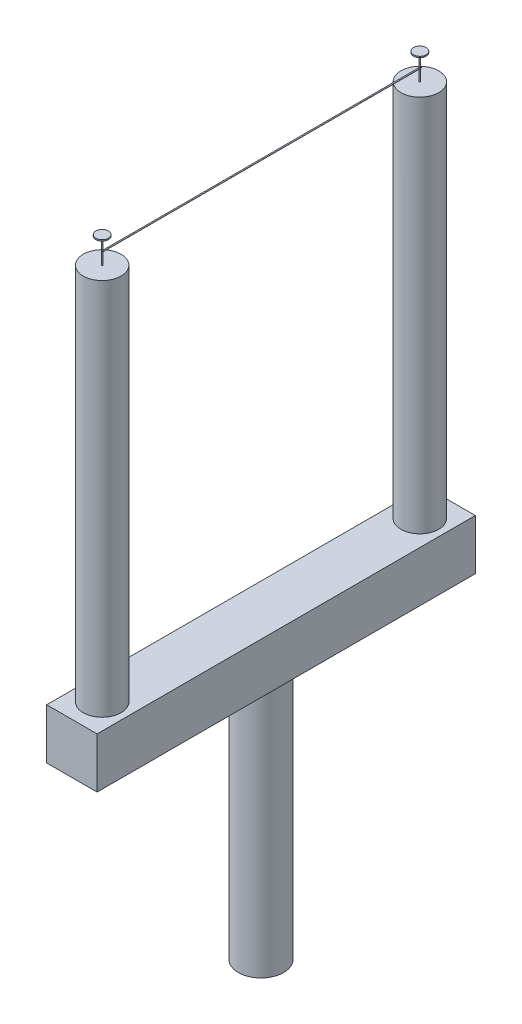
ISO-10303-21;
HEADER;
FILE_DESCRIPTION(('STEP AP214'),'2;1');
FILE_NAME('part.step','',(''),(''),'','','');
FILE_SCHEMA(('AUTOMOTIVE_DESIGN { 1 0 10303 214 1 1 1 1 }'));
ENDSEC;
DATA;
#1=APPLICATION_CONTEXT('core data for automotive mechanical design processes');
#2=APPLICATION_PROTOCOL_DEFINITION('international standard','automotive_design',2000,#1);
#3=PRODUCT_CONTEXT('',#1,'mechanical');
#4=PRODUCT('Part','Part','',(#3));
#5=PRODUCT_RELATED_PRODUCT_CATEGORY('part','',(#4));
#6=PRODUCT_DEFINITION_FORMATION('','',#4);
#7=PRODUCT_DEFINITION_CONTEXT('part definition',#1,'design');
#8=PRODUCT_DEFINITION('design','',#6,#7);
#9=PRODUCT_DEFINITION_SHAPE('','',#8);
#10=(LENGTH_UNIT() NAMED_UNIT(*) SI_UNIT(.MILLI.,.METRE.));
#11=(NAMED_UNIT(*) PLANE_ANGLE_UNIT() SI_UNIT($,.RADIAN.));
#12=(NAMED_UNIT(*) SI_UNIT($,.STERADIAN.) SOLID_ANGLE_UNIT());
#13=UNCERTAINTY_MEASURE_WITH_UNIT(LENGTH_MEASURE(1.E-05),#10,'distance_accuracy_value','');
#14=(GEOMETRIC_REPRESENTATION_CONTEXT(3) GLOBAL_UNCERTAINTY_ASSIGNED_CONTEXT((#13)) GLOBAL_UNIT_ASSIGNED_CONTEXT((#10,
#11,#12)) REPRESENTATION_CONTEXT('',''));
#15=CARTESIAN_POINT('',(0.,0.,0.));
#16=DIRECTION('',(0.,0.,1.));
#17=DIRECTION('',(1.,0.,0.));
#18=AXIS2_PLACEMENT_3D('',#15,#16,#17);
#19=CARTESIAN_POINT('',(0.,170.,138.));
#20=DIRECTION('',(0.,-1.,0.));
#21=DIRECTION('',(0.,0.,-1.));
#22=AXIS2_PLACEMENT_3D('',#19,#20,#21);
#23=CYLINDRICAL_SURFACE('',#22,0.25);
#24=CARTESIAN_POINT('',(0.,160.,138.));
#25=DIRECTION('',(0.,1.,0.));
#26=DIRECTION('',(0.,0.,1.));
#27=AXIS2_PLACEMENT_3D('',#24,#25,#26);
#28=CIRCLE('',#27,0.25);
#29=CARTESIAN_POINT('',(0.,160.,138.25));
#30=VERTEX_POINT('',#29);
#31=EDGE_CURVE('E153',#30,#30,#28,.T.);
#32=ORIENTED_EDGE('',*,*,#31,.T.);
#33=EDGE_LOOP('',(#32));
#34=FACE_BOUND('',#33,.T.);
#35=CARTESIAN_POINT('',(0.,170.,138.));
#36=DIRECTION('',(0.,1.,0.));
#37=DIRECTION('',(0.,0.,1.));
#38=AXIS2_PLACEMENT_3D('',#35,#36,#37);
#39=CIRCLE('',#38,0.25);
#40=CARTESIAN_POINT('',(0.,170.,138.25));
#41=VERTEX_POINT('',#40);
#42=EDGE_CURVE('E156',#41,#41,#39,.T.);
#43=ORIENTED_EDGE('',*,*,#42,.F.);
#44=EDGE_LOOP('',(#43));
#45=FACE_BOUND('',#44,.T.);
#46=CARTESIAN_POINT('',(0.,165.,138.));
#47=DIRECTION('',(0.,-1.,0.));
#48=DIRECTION('',(0.,0.,-1.));
#49=AXIS2_PLACEMENT_3D('',#46,#47,#48);
#50=CIRCLE('',#49,0.25);
#51=CARTESIAN_POINT('',(0.,165.,137.75));
#52=VERTEX_POINT('',#51);
#53=CARTESIAN_POINT('',(0.,165.,138.25));
#54=VERTEX_POINT('',#53);
#55=EDGE_CURVE('E11',#52,#54,#50,.T.);
#56=ORIENTED_EDGE('',*,*,#55,.F.);
#57=DIRECTION('',(0.,-1.,0.));
#58=VECTOR('',#57,1.);
#59=CARTESIAN_POINT('',(0.,170.,137.75));
#60=LINE('',#59,#58);
#61=CARTESIAN_POINT('',(0.,164.9,137.75));
#62=VERTEX_POINT('',#61);
#63=EDGE_CURVE('E41',#52,#62,#60,.T.);
#64=ORIENTED_EDGE('',*,*,#63,.T.);
#65=CARTESIAN_POINT('',(0.,164.9,138.));
#66=DIRECTION('',(0.,1.,0.));
#67=DIRECTION('',(0.,0.,1.));
#68=AXIS2_PLACEMENT_3D('',#65,#66,#67);
#69=CIRCLE('',#68,0.25);
#70=CARTESIAN_POINT('',(0.,164.9,138.25));
#71=VERTEX_POINT('',#70);
#72=EDGE_CURVE('E215',#71,#62,#69,.T.);
#73=ORIENTED_EDGE('',*,*,#72,.F.);
#74=DIRECTION('',(0.,-1.,0.));
#75=VECTOR('',#74,1.);
#76=CARTESIAN_POINT('',(0.,165.,138.25));
#77=LINE('',#76,#75);
#78=EDGE_CURVE('E224',#54,#71,#77,.T.);
#79=ORIENTED_EDGE('',*,*,#78,.F.);
#80=EDGE_LOOP('',(#56,#64,#73,#79));
#81=FACE_BOUND('',#80,.T.);
#82=ADVANCED_FACE('F33',(#34,#45,#81),#23,.T.);
#83=CARTESIAN_POINT('',(10.,-10.,150.));
#84=DIRECTION('',(-1.,0.,0.));
#85=DIRECTION('',(0.,0.,1.));
#86=AXIS2_PLACEMENT_3D('',#83,#84,#85);
#87=PLANE('',#86);
#88=DIRECTION('',(0.,1.,0.));
#89=VECTOR('',#88,1.);
#90=CARTESIAN_POINT('',(10.,-10.,0.));
#91=LINE('',#90,#89);
#92=CARTESIAN_POINT('',(10.,-10.,0.));
#93=VERTEX_POINT('',#92);
#94=CARTESIAN_POINT('',(10.,10.,0.));
#95=VERTEX_POINT('',#94);
#96=EDGE_CURVE('E176',#93,#95,#91,.T.);
#97=ORIENTED_EDGE('',*,*,#96,.T.);
#98=DIRECTION('',(0.,0.,-1.));
#99=VECTOR('',#98,1.);
#100=CARTESIAN_POINT('',(10.,10.,150.));
#101=LINE('',#100,#99);
#102=CARTESIAN_POINT('',(10.,10.,150.));
#103=VERTEX_POINT('',#102);
#104=EDGE_CURVE('E203',#103,#95,#101,.T.);
#105=ORIENTED_EDGE('',*,*,#104,.F.);
#106=DIRECTION('',(0.,1.,0.));
#107=VECTOR('',#106,1.);
#108=CARTESIAN_POINT('',(10.,-10.,150.));
#109=LINE('',#108,#107);
#110=CARTESIAN_POINT('',(10.,-10.,150.));
#111=VERTEX_POINT('',#110);
#112=EDGE_CURVE('E177',#111,#103,#109,.T.);
#113=ORIENTED_EDGE('',*,*,#112,.F.);
#114=DIRECTION('',(0.,0.,-1.));
#115=VECTOR('',#114,1.);
#116=CARTESIAN_POINT('',(10.,-10.,150.));
#117=LINE('',#116,#115);
#118=EDGE_CURVE('E187',#111,#93,#117,.T.);
#119=ORIENTED_EDGE('',*,*,#118,.T.);
#120=EDGE_LOOP('',(#97,#105,#113,#119));
#121=FACE_BOUND('',#120,.T.);
#122=ADVANCED_FACE('F35',(#121),#87,.F.);
#123=CARTESIAN_POINT('',(-10.,10.,150.));
#124=DIRECTION('',(0.,-1.,0.));
#125=DIRECTION('',(0.,0.,-1.));
#126=AXIS2_PLACEMENT_3D('',#123,#124,#125);
#127=PLANE('',#126);
#128=CARTESIAN_POINT('',(0.,10.,138.));
#129=DIRECTION('',(0.,-1.,0.));
#130=DIRECTION('',(0.,0.,-1.));
#131=AXIS2_PLACEMENT_3D('',#128,#129,#130);
#132=CIRCLE('',#131,7.5);
#133=CARTESIAN_POINT('',(0.,10.,130.5));
#134=VERTEX_POINT('',#133);
#135=EDGE_CURVE('E212',#134,#134,#132,.F.);
#136=ORIENTED_EDGE('',*,*,#135,.F.);
#137=EDGE_LOOP('',(#136));
#138=FACE_BOUND('',#137,.T.);
#139=CARTESIAN_POINT('',(0.,10.,12.));
#140=DIRECTION('',(0.,-1.,0.));
#141=DIRECTION('',(0.,0.,-1.));
#142=AXIS2_PLACEMENT_3D('',#139,#140,#141);
#143=CIRCLE('',#142,7.5);
#144=CARTESIAN_POINT('',(0.,10.,4.5));
#145=VERTEX_POINT('',#144);
#146=EDGE_CURVE('E209',#145,#145,#143,.F.);
#147=ORIENTED_EDGE('',*,*,#146,.F.);
#148=EDGE_LOOP('',(#147));
#149=FACE_BOUND('',#148,.T.);
#150=DIRECTION('',(-1.,0.,0.));
#151=VECTOR('',#150,1.);
#152=CARTESIAN_POINT('',(-10.,10.,0.));
#153=LINE('',#152,#151);
#154=CARTESIAN_POINT('',(-10.,10.,0.));
#155=VERTEX_POINT('',#154);
#156=EDGE_CURVE('E190',#95,#155,#153,.T.);
#157=ORIENTED_EDGE('',*,*,#156,.T.);
#158=DIRECTION('',(0.,0.,-1.));
#159=VECTOR('',#158,1.);
#160=CARTESIAN_POINT('',(-10.,10.,150.));
#161=LINE('',#160,#159);
#162=CARTESIAN_POINT('',(-10.,10.,150.));
#163=VERTEX_POINT('',#162);
#164=EDGE_CURVE('E200',#163,#155,#161,.T.);
#165=ORIENTED_EDGE('',*,*,#164,.F.);
#166=DIRECTION('',(-1.,0.,0.));
#167=VECTOR('',#166,1.);
#168=CARTESIAN_POINT('',(-10.,10.,150.));
#169=LINE('',#168,#167);
#170=EDGE_CURVE('E180',#103,#163,#169,.T.);
#171=ORIENTED_EDGE('',*,*,#170,.F.);
#172=ORIENTED_EDGE('',*,*,#104,.T.);
#173=EDGE_LOOP('',(#157,#165,#171,#172));
#174=FACE_BOUND('',#173,.T.);
#175=ADVANCED_FACE('F252',(#138,#149,#174),#127,.F.);
#176=CARTESIAN_POINT('',(-10.,-10.,150.));
#177=DIRECTION('',(1.,0.,0.));
#178=DIRECTION('',(0.,0.,-1.));
#179=AXIS2_PLACEMENT_3D('',#176,#177,#178);
#180=PLANE('',#179);
#181=DIRECTION('',(0.,-1.,0.));
#182=VECTOR('',#181,1.);
#183=CARTESIAN_POINT('',(-10.,-10.,0.));
#184=LINE('',#183,#182);
#185=CARTESIAN_POINT('',(-10.,-10.,0.));
#186=VERTEX_POINT('',#185);
#187=EDGE_CURVE('E192',#155,#186,#184,.T.);
#188=ORIENTED_EDGE('',*,*,#187,.T.);
#189=DIRECTION('',(0.,0.,-1.));
#190=VECTOR('',#189,1.);
#191=CARTESIAN_POINT('',(-10.,-10.,150.));
#192=LINE('',#191,#190);
#193=CARTESIAN_POINT('',(-10.,-10.,150.));
#194=VERTEX_POINT('',#193);
#195=EDGE_CURVE('E197',#194,#186,#192,.T.);
#196=ORIENTED_EDGE('',*,*,#195,.F.);
#197=DIRECTION('',(0.,-1.,0.));
#198=VECTOR('',#197,1.);
#199=CARTESIAN_POINT('',(-10.,-10.,150.));
#200=LINE('',#199,#198);
#201=EDGE_CURVE('E183',#163,#194,#200,.T.);
#202=ORIENTED_EDGE('',*,*,#201,.F.);
#203=ORIENTED_EDGE('',*,*,#164,.T.);
#204=EDGE_LOOP('',(#188,#196,#202,#203));
#205=FACE_BOUND('',#204,.T.);
#206=ADVANCED_FACE('F298',(#205),#180,.F.);
#207=CARTESIAN_POINT('',(-10.,-10.,150.));
#208=DIRECTION('',(0.,1.,0.));
#209=DIRECTION('',(0.,0.,1.));
#210=AXIS2_PLACEMENT_3D('',#207,#208,#209);
#211=PLANE('',#210);
#212=CARTESIAN_POINT('',(0.,-9.99999999999999,75.));
#213=DIRECTION('',(0.,1.,0.));
#214=DIRECTION('',(0.,0.,1.));
#215=AXIS2_PLACEMENT_3D('',#212,#213,#214);
#216=CIRCLE('',#215,9.00000000000001);
#217=CARTESIAN_POINT('',(0.,-9.99999999999999,84.));
#218=VERTEX_POINT('',#217);
#219=EDGE_CURVE('E206',#218,#218,#216,.F.);
#220=ORIENTED_EDGE('',*,*,#219,.F.);
#221=EDGE_LOOP('',(#220));
#222=FACE_BOUND('',#221,.T.);
#223=DIRECTION('',(1.,0.,0.));
#224=VECTOR('',#223,1.);
#225=CARTESIAN_POINT('',(-10.,-10.,0.));
#226=LINE('',#225,#224);
#227=EDGE_CURVE('E181',#186,#93,#226,.T.);
#228=ORIENTED_EDGE('',*,*,#227,.T.);
#229=ORIENTED_EDGE('',*,*,#118,.F.);
#230=DIRECTION('',(1.,0.,0.));
#231=VECTOR('',#230,1.);
#232=CARTESIAN_POINT('',(-10.,-10.,150.));
#233=LINE('',#232,#231);
#234=EDGE_CURVE('E185',#194,#111,#233,.T.);
#235=ORIENTED_EDGE('',*,*,#234,.F.);
#236=ORIENTED_EDGE('',*,*,#195,.T.);
#237=EDGE_LOOP('',(#228,#229,#235,#236));
#238=FACE_BOUND('',#237,.T.);
#239=ADVANCED_FACE('F291',(#222,#238),#211,.F.);
#240=CARTESIAN_POINT('',(0.,0.,150.));
#241=DIRECTION('',(0.,0.,-1.));
#242=DIRECTION('',(-1.,0.,0.));
#243=AXIS2_PLACEMENT_3D('',#240,#241,#242);
#244=PLANE('',#243);
#245=ORIENTED_EDGE('',*,*,#112,.T.);
#246=ORIENTED_EDGE('',*,*,#170,.T.);
#247=ORIENTED_EDGE('',*,*,#201,.T.);
#248=ORIENTED_EDGE('',*,*,#234,.T.);
#249=EDGE_LOOP('',(#245,#246,#247,#248));
#250=FACE_BOUND('',#249,.T.);
#251=ADVANCED_FACE('F288',(#250),#244,.F.);
#252=CARTESIAN_POINT('',(0.,0.,0.));
#253=DIRECTION('',(0.,0.,-1.));
#254=DIRECTION('',(-1.,0.,0.));
#255=AXIS2_PLACEMENT_3D('',#252,#253,#254);
#256=PLANE('',#255);
#257=ORIENTED_EDGE('',*,*,#96,.F.);
#258=ORIENTED_EDGE('',*,*,#227,.F.);
#259=ORIENTED_EDGE('',*,*,#187,.F.);
#260=ORIENTED_EDGE('',*,*,#156,.F.);
#261=EDGE_LOOP('',(#257,#258,#259,#260));
#262=FACE_BOUND('',#261,.T.);
#263=ADVANCED_FACE('F286',(#262),#256,.T.);
#264=CARTESIAN_POINT('',(0.,-110.,75.));
#265=DIRECTION('',(0.,1.,0.));
#266=DIRECTION('',(0.,0.,1.));
#267=AXIS2_PLACEMENT_3D('',#264,#265,#266);
#268=CYLINDRICAL_SURFACE('',#267,9.00000000000001);
#269=CARTESIAN_POINT('',(0.,-110.,75.));
#270=DIRECTION('',(0.,-1.,0.));
#271=DIRECTION('',(0.,0.,-1.));
#272=AXIS2_PLACEMENT_3D('',#269,#270,#271);
#273=CIRCLE('',#272,9.00000000000001);
#274=CARTESIAN_POINT('',(0.,-110.,66.));
#275=VERTEX_POINT('',#274);
#276=EDGE_CURVE('E173',#275,#275,#273,.T.);
#277=ORIENTED_EDGE('',*,*,#276,.F.);
#278=EDGE_LOOP('',(#277));
#279=FACE_BOUND('',#278,.T.);
#280=ORIENTED_EDGE('',*,*,#219,.T.);
#281=EDGE_LOOP('',(#280));
#282=FACE_BOUND('',#281,.T.);
#283=ADVANCED_FACE('F282',(#279,#282),#268,.T.);
#284=CARTESIAN_POINT('',(0.,-110.,75.));
#285=DIRECTION('',(0.,-1.,0.));
#286=DIRECTION('',(0.,0.,-1.));
#287=AXIS2_PLACEMENT_3D('',#284,#285,#286);
#288=PLANE('',#287);
#289=ORIENTED_EDGE('',*,*,#276,.T.);
#290=EDGE_LOOP('',(#289));
#291=FACE_BOUND('',#290,.T.);
#292=ADVANCED_FACE('F278',(#291),#288,.T.);
#293=CARTESIAN_POINT('',(0.,160.,12.));
#294=DIRECTION('',(0.,-1.,0.));
#295=DIRECTION('',(0.,0.,-1.));
#296=AXIS2_PLACEMENT_3D('',#293,#294,#295);
#297=CYLINDRICAL_SURFACE('',#296,7.5);
#298=CARTESIAN_POINT('',(0.,160.,12.));
#299=DIRECTION('',(0.,1.,0.));
#300=DIRECTION('',(0.,0.,1.));
#301=AXIS2_PLACEMENT_3D('',#298,#299,#300);
#302=CIRCLE('',#301,7.5);
#303=CARTESIAN_POINT('',(0.,160.,19.5));
#304=VERTEX_POINT('',#303);
#305=EDGE_CURVE('E170',#304,#304,#302,.T.);
#306=ORIENTED_EDGE('',*,*,#305,.F.);
#307=EDGE_LOOP('',(#306));
#308=FACE_BOUND('',#307,.T.);
#309=ORIENTED_EDGE('',*,*,#146,.T.);
#310=EDGE_LOOP('',(#309));
#311=FACE_BOUND('',#310,.T.);
#312=ADVANCED_FACE('F274',(#308,#311),#297,.T.);
#313=CARTESIAN_POINT('',(0.,160.,12.));
#314=DIRECTION('',(0.,1.,0.));
#315=DIRECTION('',(0.,0.,1.));
#316=AXIS2_PLACEMENT_3D('',#313,#314,#315);
#317=PLANE('',#316);
#318=CARTESIAN_POINT('',(0.,160.,12.));
#319=DIRECTION('',(0.,1.,0.));
#320=DIRECTION('',(0.,0.,1.));
#321=AXIS2_PLACEMENT_3D('',#318,#319,#320);
#322=CIRCLE('',#321,0.25);
#323=CARTESIAN_POINT('',(0.,160.,12.25));
#324=VERTEX_POINT('',#323);
#325=EDGE_CURVE('E159',#324,#324,#322,.T.);
#326=ORIENTED_EDGE('',*,*,#325,.F.);
#327=EDGE_LOOP('',(#326));
#328=FACE_BOUND('',#327,.T.);
#329=ORIENTED_EDGE('',*,*,#305,.T.);
#330=EDGE_LOOP('',(#329));
#331=FACE_BOUND('',#330,.T.);
#332=ADVANCED_FACE('F270',(#328,#331),#317,.T.);
#333=CARTESIAN_POINT('',(0.,160.,138.));
#334=DIRECTION('',(0.,-1.,0.));
#335=DIRECTION('',(0.,0.,-1.));
#336=AXIS2_PLACEMENT_3D('',#333,#334,#335);
#337=CYLINDRICAL_SURFACE('',#336,7.5);
#338=CARTESIAN_POINT('',(0.,160.,138.));
#339=DIRECTION('',(0.,1.,0.));
#340=DIRECTION('',(0.,0.,1.));
#341=AXIS2_PLACEMENT_3D('',#338,#339,#340);
#342=CIRCLE('',#341,7.5);
#343=CARTESIAN_POINT('',(0.,160.,145.5));
#344=VERTEX_POINT('',#343);
#345=EDGE_CURVE('E165',#344,#344,#342,.T.);
#346=ORIENTED_EDGE('',*,*,#345,.F.);
#347=EDGE_LOOP('',(#346));
#348=FACE_BOUND('',#347,.T.);
#349=ORIENTED_EDGE('',*,*,#135,.T.);
#350=EDGE_LOOP('',(#349));
#351=FACE_BOUND('',#350,.T.);
#352=ADVANCED_FACE('F266',(#348,#351),#337,.T.);
#353=CARTESIAN_POINT('',(0.,160.,138.));
#354=DIRECTION('',(0.,1.,0.));
#355=DIRECTION('',(0.,0.,1.));
#356=AXIS2_PLACEMENT_3D('',#353,#354,#355);
#357=PLANE('',#356);
#358=ORIENTED_EDGE('',*,*,#31,.F.);
#359=EDGE_LOOP('',(#358));
#360=FACE_BOUND('',#359,.T.);
#361=ORIENTED_EDGE('',*,*,#345,.T.);
#362=EDGE_LOOP('',(#361));
#363=FACE_BOUND('',#362,.T.);
#364=ADVANCED_FACE('F262',(#360,#363),#357,.T.);
#365=CARTESIAN_POINT('',(0.,170.,12.));
#366=DIRECTION('',(0.,-1.,0.));
#367=DIRECTION('',(0.,0.,-1.));
#368=AXIS2_PLACEMENT_3D('',#365,#366,#367);
#369=CYLINDRICAL_SURFACE('',#368,0.25);
#370=CARTESIAN_POINT('',(0.,165.,12.));
#371=DIRECTION('',(0.,-1.,0.));
#372=DIRECTION('',(0.,0.,-1.));
#373=AXIS2_PLACEMENT_3D('',#370,#371,#372);
#374=CIRCLE('',#373,0.25);
#375=CARTESIAN_POINT('',(0.,165.,11.75));
#376=VERTEX_POINT('',#375);
#377=CARTESIAN_POINT('',(0.,165.,12.25));
#378=VERTEX_POINT('',#377);
#379=EDGE_CURVE('E141',#376,#378,#374,.T.);
#380=ORIENTED_EDGE('',*,*,#379,.F.);
#381=DIRECTION('',(0.,1.,0.));
#382=VECTOR('',#381,1.);
#383=CARTESIAN_POINT('',(0.,165.,11.75));
#384=LINE('',#383,#382);
#385=CARTESIAN_POINT('',(0.,164.9,11.75));
#386=VERTEX_POINT('',#385);
#387=EDGE_CURVE('E129',#386,#376,#384,.T.);
#388=ORIENTED_EDGE('',*,*,#387,.F.);
#389=CARTESIAN_POINT('',(0.,164.9,12.));
#390=DIRECTION('',(0.,1.,0.));
#391=DIRECTION('',(0.,0.,1.));
#392=AXIS2_PLACEMENT_3D('',#389,#390,#391);
#393=CIRCLE('',#392,0.25);
#394=CARTESIAN_POINT('',(0.,164.9,12.25));
#395=VERTEX_POINT('',#394);
#396=EDGE_CURVE('E134',#395,#386,#393,.T.);
#397=ORIENTED_EDGE('',*,*,#396,.F.);
#398=DIRECTION('',(0.,-1.,0.));
#399=VECTOR('',#398,1.);
#400=CARTESIAN_POINT('',(0.,170.,12.25));
#401=LINE('',#400,#399);
#402=EDGE_CURVE('E131',#395,#378,#401,.F.);
#403=ORIENTED_EDGE('',*,*,#402,.T.);
#404=EDGE_LOOP('',(#380,#388,#397,#403));
#405=FACE_BOUND('',#404,.T.);
#406=CARTESIAN_POINT('',(0.,170.,12.));
#407=DIRECTION('',(0.,1.,0.));
#408=DIRECTION('',(0.,0.,1.));
#409=AXIS2_PLACEMENT_3D('',#406,#407,#408);
#410=CIRCLE('',#409,0.25);
#411=CARTESIAN_POINT('',(0.,170.,12.25));
#412=VERTEX_POINT('',#411);
#413=EDGE_CURVE('E162',#412,#412,#410,.T.);
#414=ORIENTED_EDGE('',*,*,#413,.F.);
#415=EDGE_LOOP('',(#414));
#416=FACE_BOUND('',#415,.T.);
#417=ORIENTED_EDGE('',*,*,#325,.T.);
#418=EDGE_LOOP('',(#417));
#419=FACE_BOUND('',#418,.T.);
#420=ADVANCED_FACE('F259',(#405,#416,#419),#369,.T.);
#421=CARTESIAN_POINT('',(0.,170.5,12.));
#422=DIRECTION('',(0.,-1.,0.));
#423=DIRECTION('',(0.,0.,-1.));
#424=AXIS2_PLACEMENT_3D('',#421,#422,#423);
#425=CYLINDRICAL_SURFACE('',#424,2.5);
#426=CARTESIAN_POINT('',(0.,170.5,12.));
#427=DIRECTION('',(0.,1.,0.));
#428=DIRECTION('',(0.,0.,1.));
#429=AXIS2_PLACEMENT_3D('',#426,#427,#428);
#430=CIRCLE('',#429,2.5);
#431=CARTESIAN_POINT('',(0.,170.5,14.5));
#432=VERTEX_POINT('',#431);
#433=EDGE_CURVE('E150',#432,#432,#430,.T.);
#434=ORIENTED_EDGE('',*,*,#433,.F.);
#435=EDGE_LOOP('',(#434));
#436=FACE_BOUND('',#435,.T.);
#437=CARTESIAN_POINT('',(0.,170.,12.));
#438=DIRECTION('',(0.,1.,0.));
#439=DIRECTION('',(0.,0.,1.));
#440=AXIS2_PLACEMENT_3D('',#437,#438,#439);
#441=CIRCLE('',#440,2.5);
#442=CARTESIAN_POINT('',(0.,170.,14.5));
#443=VERTEX_POINT('',#442);
#444=EDGE_CURVE('E147',#443,#443,#441,.T.);
#445=ORIENTED_EDGE('',*,*,#444,.T.);
#446=EDGE_LOOP('',(#445));
#447=FACE_BOUND('',#446,.T.);
#448=ADVANCED_FACE('F257',(#436,#447),#425,.T.);
#449=CARTESIAN_POINT('',(0.,170.5,12.));
#450=DIRECTION('',(0.,1.,0.));
#451=DIRECTION('',(0.,0.,1.));
#452=AXIS2_PLACEMENT_3D('',#449,#450,#451);
#453=PLANE('',#452);
#454=ORIENTED_EDGE('',*,*,#433,.T.);
#455=EDGE_LOOP('',(#454));
#456=FACE_BOUND('',#455,.T.);
#457=ADVANCED_FACE('F376',(#456),#453,.T.);
#458=CARTESIAN_POINT('',(0.,170.,12.));
#459=DIRECTION('',(0.,1.,0.));
#460=DIRECTION('',(0.,0.,1.));
#461=AXIS2_PLACEMENT_3D('',#458,#459,#460);
#462=PLANE('',#461);
#463=ORIENTED_EDGE('',*,*,#413,.T.);
#464=EDGE_LOOP('',(#463));
#465=FACE_BOUND('',#464,.T.);
#466=ORIENTED_EDGE('',*,*,#444,.F.);
#467=EDGE_LOOP('',(#466));
#468=FACE_BOUND('',#467,.T.);
#469=ADVANCED_FACE('F383',(#465,#468),#462,.F.);
#470=CARTESIAN_POINT('',(0.,170.5,138.));
#471=DIRECTION('',(0.,-1.,0.));
#472=DIRECTION('',(0.,0.,-1.));
#473=AXIS2_PLACEMENT_3D('',#470,#471,#472);
#474=CYLINDRICAL_SURFACE('',#473,2.5);
#475=CARTESIAN_POINT('',(0.,170.5,138.));
#476=DIRECTION('',(0.,1.,0.));
#477=DIRECTION('',(0.,0.,1.));
#478=AXIS2_PLACEMENT_3D('',#475,#476,#477);
#479=CIRCLE('',#478,2.5);
#480=CARTESIAN_POINT('',(0.,170.5,140.5));
#481=VERTEX_POINT('',#480);
#482=EDGE_CURVE('E144',#481,#481,#479,.T.);
#483=ORIENTED_EDGE('',*,*,#482,.F.);
#484=EDGE_LOOP('',(#483));
#485=FACE_BOUND('',#484,.T.);
#486=CARTESIAN_POINT('',(0.,170.,138.));
#487=DIRECTION('',(0.,1.,0.));
#488=DIRECTION('',(0.,0.,1.));
#489=AXIS2_PLACEMENT_3D('',#486,#487,#488);
#490=CIRCLE('',#489,2.5);
#491=CARTESIAN_POINT('',(0.,170.,140.5));
#492=VERTEX_POINT('',#491);
#493=EDGE_CURVE('E143',#492,#492,#490,.T.);
#494=ORIENTED_EDGE('',*,*,#493,.T.);
#495=EDGE_LOOP('',(#494));
#496=FACE_BOUND('',#495,.T.);
#497=ADVANCED_FACE('F391',(#485,#496),#474,.T.);
#498=CARTESIAN_POINT('',(0.,170.5,138.));
#499=DIRECTION('',(0.,1.,0.));
#500=DIRECTION('',(0.,0.,1.));
#501=AXIS2_PLACEMENT_3D('',#498,#499,#500);
#502=PLANE('',#501);
#503=ORIENTED_EDGE('',*,*,#482,.T.);
#504=EDGE_LOOP('',(#503));
#505=FACE_BOUND('',#504,.T.);
#506=ADVANCED_FACE('F398',(#505),#502,.T.);
#507=CARTESIAN_POINT('',(0.,170.,138.));
#508=DIRECTION('',(0.,1.,0.));
#509=DIRECTION('',(0.,0.,1.));
#510=AXIS2_PLACEMENT_3D('',#507,#508,#509);
#511=PLANE('',#510);
#512=ORIENTED_EDGE('',*,*,#42,.T.);
#513=EDGE_LOOP('',(#512));
#514=FACE_BOUND('',#513,.T.);
#515=ORIENTED_EDGE('',*,*,#493,.F.);
#516=EDGE_LOOP('',(#515));
#517=FACE_BOUND('',#516,.T.);
#518=ADVANCED_FACE('F406',(#514,#517),#511,.F.);
#519=CARTESIAN_POINT('',(0.,0.,0.));
#520=DIRECTION('',(-1.,0.,0.));
#521=DIRECTION('',(0.,0.,1.));
#522=AXIS2_PLACEMENT_3D('',#519,#520,#521);
#523=PLANE('',#522);
#524=ORIENTED_EDGE('',*,*,#402,.F.);
#525=DIRECTION('',(0.,0.,-1.));
#526=VECTOR('',#525,1.);
#527=CARTESIAN_POINT('',(0.,164.9,11.75));
#528=LINE('',#527,#526);
#529=EDGE_CURVE('E125',#62,#395,#528,.T.);
#530=ORIENTED_EDGE('',*,*,#529,.F.);
#531=ORIENTED_EDGE('',*,*,#63,.F.);
#532=DIRECTION('',(0.,0.,1.));
#533=VECTOR('',#532,1.);
#534=CARTESIAN_POINT('',(0.,165.,11.75));
#535=LINE('',#534,#533);
#536=EDGE_CURVE('E48',#378,#52,#535,.T.);
#537=ORIENTED_EDGE('',*,*,#536,.F.);
#538=EDGE_LOOP('',(#524,#530,#531,#537));
#539=FACE_BOUND('',#538,.T.);
#540=ADVANCED_FACE('F222',(#539),#523,.T.);
#541=CARTESIAN_POINT('',(0.5,165.,11.75));
#542=DIRECTION('',(0.,0.,1.));
#543=DIRECTION('',(1.,0.,0.));
#544=AXIS2_PLACEMENT_3D('',#541,#542,#543);
#545=PLANE('',#544);
#546=ORIENTED_EDGE('',*,*,#387,.T.);
#547=DIRECTION('',(-1.,0.,0.));
#548=VECTOR('',#547,1.);
#549=CARTESIAN_POINT('',(0.5,165.,11.75));
#550=LINE('',#549,#548);
#551=CARTESIAN_POINT('',(0.5,165.,11.75));
#552=VERTEX_POINT('',#551);
#553=EDGE_CURVE('E112',#552,#376,#550,.T.);
#554=ORIENTED_EDGE('',*,*,#553,.F.);
#555=DIRECTION('',(0.,1.,0.));
#556=VECTOR('',#555,1.);
#557=CARTESIAN_POINT('',(0.5,165.,11.75));
#558=LINE('',#557,#556);
#559=CARTESIAN_POINT('',(0.5,164.9,11.75));
#560=VERTEX_POINT('',#559);
#561=EDGE_CURVE('E116',#560,#552,#558,.T.);
#562=ORIENTED_EDGE('',*,*,#561,.F.);
#563=DIRECTION('',(-1.,0.,0.));
#564=VECTOR('',#563,1.);
#565=CARTESIAN_POINT('',(0.5,164.9,11.75));
#566=LINE('',#565,#564);
#567=EDGE_CURVE('E231',#560,#386,#566,.T.);
#568=ORIENTED_EDGE('',*,*,#567,.T.);
#569=EDGE_LOOP('',(#546,#554,#562,#568));
#570=FACE_BOUND('',#569,.T.);
#571=ADVANCED_FACE('F127',(#570),#545,.F.);
#572=CARTESIAN_POINT('',(0.5,165.,11.75));
#573=DIRECTION('',(0.,-1.,0.));
#574=DIRECTION('',(0.,0.,-1.));
#575=AXIS2_PLACEMENT_3D('',#572,#573,#574);
#576=PLANE('',#575);
#577=ORIENTED_EDGE('',*,*,#553,.T.);
#578=ORIENTED_EDGE('',*,*,#379,.T.);
#579=ORIENTED_EDGE('',*,*,#536,.T.);
#580=ORIENTED_EDGE('',*,*,#55,.T.);
#581=DIRECTION('',(-1.,0.,0.));
#582=VECTOR('',#581,1.);
#583=CARTESIAN_POINT('',(0.5,165.,138.25));
#584=LINE('',#583,#582);
#585=CARTESIAN_POINT('',(0.5,165.,138.25));
#586=VERTEX_POINT('',#585);
#587=EDGE_CURVE('E56',#586,#54,#584,.T.);
#588=ORIENTED_EDGE('',*,*,#587,.F.);
#589=DIRECTION('',(0.,0.,1.));
#590=VECTOR('',#589,1.);
#591=CARTESIAN_POINT('',(0.5,165.,11.75));
#592=LINE('',#591,#590);
#593=EDGE_CURVE('E108',#552,#586,#592,.T.);
#594=ORIENTED_EDGE('',*,*,#593,.F.);
#595=EDGE_LOOP('',(#577,#578,#579,#580,#588,#594));
#596=FACE_BOUND('',#595,.T.);
#597=ADVANCED_FACE('F110',(#596),#576,.F.);
#598=CARTESIAN_POINT('',(0.5,165.,138.25));
#599=DIRECTION('',(0.,0.,-1.));
#600=DIRECTION('',(-1.,0.,0.));
#601=AXIS2_PLACEMENT_3D('',#598,#599,#600);
#602=PLANE('',#601);
#603=ORIENTED_EDGE('',*,*,#78,.T.);
#604=DIRECTION('',(-1.,0.,0.));
#605=VECTOR('',#604,1.);
#606=CARTESIAN_POINT('',(0.5,164.9,138.25));
#607=LINE('',#606,#605);
#608=CARTESIAN_POINT('',(0.5,164.9,138.25));
#609=VERTEX_POINT('',#608);
#610=EDGE_CURVE('E136',#609,#71,#607,.T.);
#611=ORIENTED_EDGE('',*,*,#610,.F.);
#612=DIRECTION('',(0.,-1.,0.));
#613=VECTOR('',#612,1.);
#614=CARTESIAN_POINT('',(0.5,165.,138.25));
#615=LINE('',#614,#613);
#616=EDGE_CURVE('E115',#586,#609,#615,.T.);
#617=ORIENTED_EDGE('',*,*,#616,.F.);
#618=ORIENTED_EDGE('',*,*,#587,.T.);
#619=EDGE_LOOP('',(#603,#611,#617,#618));
#620=FACE_BOUND('',#619,.T.);
#621=ADVANCED_FACE('F236',(#620),#602,.F.);
#622=CARTESIAN_POINT('',(0.5,164.9,11.75));
#623=DIRECTION('',(0.,1.,0.));
#624=DIRECTION('',(0.,0.,1.));
#625=AXIS2_PLACEMENT_3D('',#622,#623,#624);
#626=PLANE('',#625);
#627=ORIENTED_EDGE('',*,*,#529,.T.);
#628=ORIENTED_EDGE('',*,*,#396,.T.);
#629=ORIENTED_EDGE('',*,*,#567,.F.);
#630=DIRECTION('',(0.,0.,-1.));
#631=VECTOR('',#630,1.);
#632=CARTESIAN_POINT('',(0.5,164.9,11.75));
#633=LINE('',#632,#631);
#634=EDGE_CURVE('E121',#609,#560,#633,.T.);
#635=ORIENTED_EDGE('',*,*,#634,.F.);
#636=ORIENTED_EDGE('',*,*,#610,.T.);
#637=ORIENTED_EDGE('',*,*,#72,.T.);
#638=EDGE_LOOP('',(#627,#628,#629,#635,#636,#637));
#639=FACE_BOUND('',#638,.T.);
#640=ADVANCED_FACE('F235',(#639),#626,.F.);
#641=CARTESIAN_POINT('',(0.5,0.,0.));
#642=DIRECTION('',(-1.,0.,0.));
#643=DIRECTION('',(0.,0.,1.));
#644=AXIS2_PLACEMENT_3D('',#641,#642,#643);
#645=PLANE('',#644);
#646=ORIENTED_EDGE('',*,*,#561,.T.);
#647=ORIENTED_EDGE('',*,*,#593,.T.);
#648=ORIENTED_EDGE('',*,*,#616,.T.);
#649=ORIENTED_EDGE('',*,*,#634,.T.);
#650=EDGE_LOOP('',(#646,#647,#648,#649));
#651=FACE_BOUND('',#650,.T.);
#652=ADVANCED_FACE('F119',(#651),#645,.F.);
#653=CLOSED_SHELL('',(#82,#122,#175,#206,#239,#251,#263,#283,#292,#312,#332,#352,#364,#420,#448,
#457,#469,#497,#506,#518,#540,#571,#597,#621,#640,#652));
#654=MANIFOLD_SOLID_BREP('B2',#653);
#655=ADVANCED_BREP_SHAPE_REPRESENTATION('',(#18,#654),#14);
#656=SHAPE_DEFINITION_REPRESENTATION(#9,#655);
ENDSEC;
END-ISO-10303-21;
